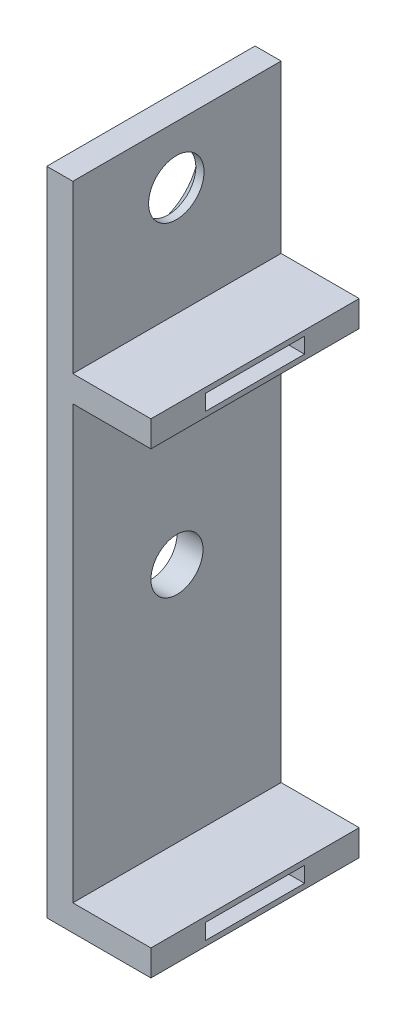
ISO-10303-21;
HEADER;
FILE_DESCRIPTION(('STEP AP214'),'2;1');
FILE_NAME('part.step','',(''),(''),'','','');
FILE_SCHEMA(('AUTOMOTIVE_DESIGN { 1 0 10303 214 1 1 1 1 }'));
ENDSEC;
DATA;
#1=APPLICATION_CONTEXT('core data for automotive mechanical design processes');
#2=APPLICATION_PROTOCOL_DEFINITION('international standard','automotive_design',2000,#1);
#3=PRODUCT_CONTEXT('',#1,'mechanical');
#4=PRODUCT('Part','Part','',(#3));
#5=PRODUCT_RELATED_PRODUCT_CATEGORY('part','',(#4));
#6=PRODUCT_DEFINITION_FORMATION('','',#4);
#7=PRODUCT_DEFINITION_CONTEXT('part definition',#1,'design');
#8=PRODUCT_DEFINITION('design','',#6,#7);
#9=PRODUCT_DEFINITION_SHAPE('','',#8);
#10=(LENGTH_UNIT() NAMED_UNIT(*) SI_UNIT(.MILLI.,.METRE.));
#11=(NAMED_UNIT(*) PLANE_ANGLE_UNIT() SI_UNIT($,.RADIAN.));
#12=(NAMED_UNIT(*) SI_UNIT($,.STERADIAN.) SOLID_ANGLE_UNIT());
#13=UNCERTAINTY_MEASURE_WITH_UNIT(LENGTH_MEASURE(1.E-05),#10,'distance_accuracy_value','');
#14=(GEOMETRIC_REPRESENTATION_CONTEXT(3) GLOBAL_UNCERTAINTY_ASSIGNED_CONTEXT((#13)) GLOBAL_UNIT_ASSIGNED_CONTEXT((#10,
#11,#12)) REPRESENTATION_CONTEXT('',''));
#15=CARTESIAN_POINT('',(0.,0.,0.));
#16=DIRECTION('',(0.,0.,1.));
#17=DIRECTION('',(1.,0.,0.));
#18=AXIS2_PLACEMENT_3D('',#15,#16,#17);
#19=CARTESIAN_POINT('',(-22.4832333333333,11.63955,10.16));
#20=DIRECTION('',(-1.,0.,0.));
#21=DIRECTION('',(0.,-1.,0.));
#22=AXIS2_PLACEMENT_3D('',#19,#20,#21);
#23=PLANE('',#22);
#24=CARTESIAN_POINT('',(-22.4832333333333,-7.08439638807882,5.08));
#25=DIRECTION('',(1.,0.,0.));
#26=DIRECTION('',(0.,1.,0.));
#27=AXIS2_PLACEMENT_3D('',#24,#25,#26);
#28=CIRCLE('',#27,1.27);
#29=CARTESIAN_POINT('',(-22.4832333333333,-5.81439638807882,5.08));
#30=VERTEX_POINT('',#29);
#31=EDGE_CURVE('E199',#30,#30,#28,.T.);
#32=ORIENTED_EDGE('',*,*,#31,.F.);
#33=EDGE_LOOP('',(#32));
#34=FACE_BOUND('',#33,.T.);
#35=DIRECTION('',(0.,0.,-1.));
#36=VECTOR('',#35,1.);
#37=CARTESIAN_POINT('',(-22.4832333333333,2.24155,10.16));
#38=LINE('',#37,#36);
#39=CARTESIAN_POINT('',(-22.4832333333333,2.24155000000001,10.16));
#40=VERTEX_POINT('',#39);
#41=CARTESIAN_POINT('',(-22.4832333333333,2.24155000000001,0.));
#42=VERTEX_POINT('',#41);
#43=EDGE_CURVE('E257',#40,#42,#38,.T.);
#44=ORIENTED_EDGE('',*,*,#43,.F.);
#45=DIRECTION('',(0.,1.,0.));
#46=VECTOR('',#45,1.);
#47=CARTESIAN_POINT('',(-22.4832333333333,11.63955,10.16));
#48=LINE('',#47,#46);
#49=CARTESIAN_POINT('',(-22.4832333333333,-18.84045,10.16));
#50=VERTEX_POINT('',#49);
#51=EDGE_CURVE('E321',#50,#40,#48,.T.);
#52=ORIENTED_EDGE('',*,*,#51,.F.);
#53=DIRECTION('',(0.,0.,-1.));
#54=VECTOR('',#53,1.);
#55=CARTESIAN_POINT('',(-22.4832333333333,-18.84045,10.16));
#56=LINE('',#55,#54);
#57=CARTESIAN_POINT('',(-22.4832333333333,-18.84045,0.));
#58=VERTEX_POINT('',#57);
#59=EDGE_CURVE('E347',#50,#58,#56,.T.);
#60=ORIENTED_EDGE('',*,*,#59,.T.);
#61=DIRECTION('',(0.,1.,0.));
#62=VECTOR('',#61,1.);
#63=CARTESIAN_POINT('',(-22.4832333333333,11.63955,0.));
#64=LINE('',#63,#62);
#65=EDGE_CURVE('E308',#58,#42,#64,.T.);
#66=ORIENTED_EDGE('',*,*,#65,.T.);
#67=EDGE_LOOP('',(#44,#52,#60,#66));
#68=FACE_BOUND('',#67,.T.);
#69=ADVANCED_FACE('F41',(#34,#68),#23,.F.);
#70=CARTESIAN_POINT('',(-22.4832333333333,8.84555,5.11168207856704));
#71=DIRECTION('',(-1.,0.,0.));
#72=DIRECTION('',(0.,-1.,0.));
#73=AXIS2_PLACEMENT_3D('',#70,#71,#72);
#74=CIRCLE('',#73,1.35254999999999);
#75=CARTESIAN_POINT('',(-22.4832333333333,7.49300000000001,5.11168207856704));
#76=VERTEX_POINT('',#75);
#77=EDGE_CURVE('E45',#76,#76,#74,.T.);
#78=ORIENTED_EDGE('',*,*,#77,.T.);
#79=EDGE_LOOP('',(#78));
#80=FACE_BOUND('',#79,.T.);
#81=DIRECTION('',(0.,0.,1.));
#82=VECTOR('',#81,1.);
#83=CARTESIAN_POINT('',(-22.4832333333333,3.51155,0.));
#84=LINE('',#83,#82);
#85=CARTESIAN_POINT('',(-22.4832333333333,3.51155,0.));
#86=VERTEX_POINT('',#85);
#87=CARTESIAN_POINT('',(-22.4832333333333,3.51155000000001,10.16));
#88=VERTEX_POINT('',#87);
#89=EDGE_CURVE('E271',#86,#88,#84,.T.);
#90=ORIENTED_EDGE('',*,*,#89,.F.);
#91=CARTESIAN_POINT('',(-22.4832333333333,11.63955,0.));
#92=VERTEX_POINT('',#91);
#93=EDGE_CURVE('E341',#86,#92,#64,.T.);
#94=ORIENTED_EDGE('',*,*,#93,.T.);
#95=DIRECTION('',(0.,0.,-1.));
#96=VECTOR('',#95,1.);
#97=CARTESIAN_POINT('',(-22.4832333333333,11.63955,10.16));
#98=LINE('',#97,#96);
#99=CARTESIAN_POINT('',(-22.4832333333333,11.63955,10.16));
#100=VERTEX_POINT('',#99);
#101=EDGE_CURVE('E325',#100,#92,#98,.T.);
#102=ORIENTED_EDGE('',*,*,#101,.F.);
#103=EDGE_CURVE('E320',#88,#100,#48,.T.);
#104=ORIENTED_EDGE('',*,*,#103,.F.);
#105=EDGE_LOOP('',(#90,#94,#102,#104));
#106=FACE_BOUND('',#105,.T.);
#107=ADVANCED_FACE('F423',(#80,#106),#23,.F.);
#108=CARTESIAN_POINT('',(-23.7532333333333,11.63955,10.16));
#109=DIRECTION('',(0.,-1.,0.));
#110=DIRECTION('',(0.,0.,-1.));
#111=AXIS2_PLACEMENT_3D('',#108,#109,#110);
#112=PLANE('',#111);
#113=DIRECTION('',(-1.,0.,0.));
#114=VECTOR('',#113,1.);
#115=CARTESIAN_POINT('',(-23.7532333333333,11.63955,0.));
#116=LINE('',#115,#114);
#117=CARTESIAN_POINT('',(-23.7532333333333,11.63955,0.));
#118=VERTEX_POINT('',#117);
#119=EDGE_CURVE('E302',#92,#118,#116,.T.);
#120=ORIENTED_EDGE('',*,*,#119,.T.);
#121=DIRECTION('',(0.,0.,-1.));
#122=VECTOR('',#121,1.);
#123=CARTESIAN_POINT('',(-23.7532333333333,11.63955,10.16));
#124=LINE('',#123,#122);
#125=CARTESIAN_POINT('',(-23.7532333333333,11.63955,10.16));
#126=VERTEX_POINT('',#125);
#127=EDGE_CURVE('E11',#126,#118,#124,.T.);
#128=ORIENTED_EDGE('',*,*,#127,.F.);
#129=DIRECTION('',(-1.,0.,0.));
#130=VECTOR('',#129,1.);
#131=CARTESIAN_POINT('',(-23.7532333333333,11.63955,10.16));
#132=LINE('',#131,#130);
#133=EDGE_CURVE('E303',#100,#126,#132,.T.);
#134=ORIENTED_EDGE('',*,*,#133,.F.);
#135=ORIENTED_EDGE('',*,*,#101,.T.);
#136=EDGE_LOOP('',(#120,#128,#134,#135));
#137=FACE_BOUND('',#136,.T.);
#138=ADVANCED_FACE('F43',(#137),#112,.F.);
#139=CARTESIAN_POINT('',(-23.7532333333333,-20.11045,10.16));
#140=DIRECTION('',(1.,0.,0.));
#141=DIRECTION('',(0.,0.,-1.));
#142=AXIS2_PLACEMENT_3D('',#139,#140,#141);
#143=PLANE('',#142);
#144=CARTESIAN_POINT('',(-23.7532333333333,8.84555,5.11168207856704));
#145=DIRECTION('',(-1.,0.,0.));
#146=DIRECTION('',(0.,0.,1.));
#147=AXIS2_PLACEMENT_3D('',#144,#145,#146);
#148=CIRCLE('',#147,2.3876);
#149=CARTESIAN_POINT('',(-23.7532333333333,8.84555,7.49928207856704));
#150=VERTEX_POINT('',#149);
#151=EDGE_CURVE('E376',#150,#150,#148,.T.);
#152=ORIENTED_EDGE('',*,*,#151,.F.);
#153=EDGE_LOOP('',(#152));
#154=FACE_BOUND('',#153,.T.);
#155=CARTESIAN_POINT('',(-23.7532333333333,-7.08439638807882,5.08));
#156=DIRECTION('',(1.,0.,0.));
#157=DIRECTION('',(0.,0.,-1.));
#158=AXIS2_PLACEMENT_3D('',#155,#156,#157);
#159=CIRCLE('',#158,1.27);
#160=CARTESIAN_POINT('',(-23.7532333333333,-7.08439638807882,3.81));
#161=VERTEX_POINT('',#160);
#162=EDGE_CURVE('E209',#161,#161,#159,.T.);
#163=ORIENTED_EDGE('',*,*,#162,.T.);
#164=EDGE_LOOP('',(#163));
#165=FACE_BOUND('',#164,.T.);
#166=DIRECTION('',(0.,-1.,0.));
#167=VECTOR('',#166,1.);
#168=CARTESIAN_POINT('',(-23.7532333333333,-20.11045,0.));
#169=LINE('',#168,#167);
#170=CARTESIAN_POINT('',(-23.7532333333333,-20.11045,0.));
#171=VERTEX_POINT('',#170);
#172=EDGE_CURVE('E329',#118,#171,#169,.T.);
#173=ORIENTED_EDGE('',*,*,#172,.T.);
#174=DIRECTION('',(0.,0.,-1.));
#175=VECTOR('',#174,1.);
#176=CARTESIAN_POINT('',(-23.7532333333333,-20.11045,10.16));
#177=LINE('',#176,#175);
#178=CARTESIAN_POINT('',(-23.7532333333333,-20.11045,10.16));
#179=VERTEX_POINT('',#178);
#180=EDGE_CURVE('E51',#179,#171,#177,.T.);
#181=ORIENTED_EDGE('',*,*,#180,.F.);
#182=DIRECTION('',(0.,-1.,0.));
#183=VECTOR('',#182,1.);
#184=CARTESIAN_POINT('',(-23.7532333333333,-20.11045,10.16));
#185=LINE('',#184,#183);
#186=EDGE_CURVE('E307',#126,#179,#185,.T.);
#187=ORIENTED_EDGE('',*,*,#186,.F.);
#188=ORIENTED_EDGE('',*,*,#127,.T.);
#189=EDGE_LOOP('',(#173,#181,#187,#188));
#190=FACE_BOUND('',#189,.T.);
#191=ADVANCED_FACE('F386',(#154,#165,#190),#143,.F.);
#192=CARTESIAN_POINT('',(-18.6732333333333,-20.11045,10.16));
#193=DIRECTION('',(0.,1.,0.));
#194=DIRECTION('',(0.,0.,1.));
#195=AXIS2_PLACEMENT_3D('',#192,#193,#194);
#196=PLANE('',#195);
#197=DIRECTION('',(1.,0.,0.));
#198=VECTOR('',#197,1.);
#199=CARTESIAN_POINT('',(-18.6732333333333,-20.11045,0.));
#200=LINE('',#199,#198);
#201=CARTESIAN_POINT('',(-18.6732333333333,-20.11045,0.));
#202=VERTEX_POINT('',#201);
#203=EDGE_CURVE('E332',#171,#202,#200,.T.);
#204=ORIENTED_EDGE('',*,*,#203,.T.);
#205=DIRECTION('',(0.,0.,-1.));
#206=VECTOR('',#205,1.);
#207=CARTESIAN_POINT('',(-18.6732333333333,-20.11045,10.16));
#208=LINE('',#207,#206);
#209=CARTESIAN_POINT('',(-18.6732333333333,-20.11045,10.16));
#210=VERTEX_POINT('',#209);
#211=EDGE_CURVE('E355',#210,#202,#208,.T.);
#212=ORIENTED_EDGE('',*,*,#211,.F.);
#213=DIRECTION('',(1.,0.,0.));
#214=VECTOR('',#213,1.);
#215=CARTESIAN_POINT('',(-18.6732333333333,-20.11045,10.16));
#216=LINE('',#215,#214);
#217=EDGE_CURVE('E311',#179,#210,#216,.T.);
#218=ORIENTED_EDGE('',*,*,#217,.F.);
#219=ORIENTED_EDGE('',*,*,#180,.T.);
#220=EDGE_LOOP('',(#204,#212,#218,#219));
#221=FACE_BOUND('',#220,.T.);
#222=ADVANCED_FACE('F388',(#221),#196,.F.);
#223=CARTESIAN_POINT('',(-18.6732333333333,-18.84045,10.16));
#224=DIRECTION('',(-1.,0.,0.));
#225=DIRECTION('',(0.,0.,1.));
#226=AXIS2_PLACEMENT_3D('',#223,#224,#225);
#227=PLANE('',#226);
#228=DIRECTION('',(0.,0.,-1.));
#229=VECTOR('',#228,1.);
#230=CARTESIAN_POINT('',(-18.6732333333333,-19.85645,7.493));
#231=LINE('',#230,#229);
#232=CARTESIAN_POINT('',(-18.6732333333333,-19.85645,7.493));
#233=VERTEX_POINT('',#232);
#234=CARTESIAN_POINT('',(-18.6732333333333,-19.85645,2.667));
#235=VERTEX_POINT('',#234);
#236=EDGE_CURVE('E208',#233,#235,#231,.T.);
#237=ORIENTED_EDGE('',*,*,#236,.F.);
#238=DIRECTION('',(0.,-1.,0.));
#239=VECTOR('',#238,1.);
#240=CARTESIAN_POINT('',(-18.6732333333333,-19.09445,7.493));
#241=LINE('',#240,#239);
#242=CARTESIAN_POINT('',(-18.6732333333333,-19.09445,7.493));
#243=VERTEX_POINT('',#242);
#244=EDGE_CURVE('E59',#243,#233,#241,.T.);
#245=ORIENTED_EDGE('',*,*,#244,.F.);
#246=DIRECTION('',(0.,0.,1.));
#247=VECTOR('',#246,1.);
#248=CARTESIAN_POINT('',(-18.6732333333333,-19.09445,2.667));
#249=LINE('',#248,#247);
#250=CARTESIAN_POINT('',(-18.6732333333333,-19.09445,2.667));
#251=VERTEX_POINT('',#250);
#252=EDGE_CURVE('E192',#251,#243,#249,.T.);
#253=ORIENTED_EDGE('',*,*,#252,.F.);
#254=DIRECTION('',(0.,1.,0.));
#255=VECTOR('',#254,1.);
#256=CARTESIAN_POINT('',(-18.6732333333333,-19.85645,2.667));
#257=LINE('',#256,#255);
#258=EDGE_CURVE('E196',#235,#251,#257,.T.);
#259=ORIENTED_EDGE('',*,*,#258,.F.);
#260=EDGE_LOOP('',(#237,#245,#253,#259));
#261=FACE_BOUND('',#260,.T.);
#262=DIRECTION('',(0.,1.,0.));
#263=VECTOR('',#262,1.);
#264=CARTESIAN_POINT('',(-18.6732333333333,-18.84045,0.));
#265=LINE('',#264,#263);
#266=CARTESIAN_POINT('',(-18.6732333333333,-18.84045,0.));
#267=VERTEX_POINT('',#266);
#268=EDGE_CURVE('E335',#202,#267,#265,.T.);
#269=ORIENTED_EDGE('',*,*,#268,.T.);
#270=DIRECTION('',(0.,0.,-1.));
#271=VECTOR('',#270,1.);
#272=CARTESIAN_POINT('',(-18.6732333333333,-18.84045,10.16));
#273=LINE('',#272,#271);
#274=CARTESIAN_POINT('',(-18.6732333333333,-18.84045,10.16));
#275=VERTEX_POINT('',#274);
#276=EDGE_CURVE('E351',#275,#267,#273,.T.);
#277=ORIENTED_EDGE('',*,*,#276,.F.);
#278=DIRECTION('',(0.,1.,0.));
#279=VECTOR('',#278,1.);
#280=CARTESIAN_POINT('',(-18.6732333333333,-18.84045,10.16));
#281=LINE('',#280,#279);
#282=EDGE_CURVE('E314',#210,#275,#281,.T.);
#283=ORIENTED_EDGE('',*,*,#282,.F.);
#284=ORIENTED_EDGE('',*,*,#211,.T.);
#285=EDGE_LOOP('',(#269,#277,#283,#284));
#286=FACE_BOUND('',#285,.T.);
#287=ADVANCED_FACE('F404',(#261,#286),#227,.F.);
#288=CARTESIAN_POINT('',(-22.4832333333333,-18.84045,10.16));
#289=DIRECTION('',(0.,-1.,0.));
#290=DIRECTION('',(0.,0.,-1.));
#291=AXIS2_PLACEMENT_3D('',#288,#289,#290);
#292=PLANE('',#291);
#293=DIRECTION('',(-1.,0.,0.));
#294=VECTOR('',#293,1.);
#295=CARTESIAN_POINT('',(-22.4832333333333,-18.84045,0.));
#296=LINE('',#295,#294);
#297=EDGE_CURVE('E338',#267,#58,#296,.T.);
#298=ORIENTED_EDGE('',*,*,#297,.T.);
#299=ORIENTED_EDGE('',*,*,#59,.F.);
#300=DIRECTION('',(-1.,0.,0.));
#301=VECTOR('',#300,1.);
#302=CARTESIAN_POINT('',(-22.4832333333333,-18.84045,10.16));
#303=LINE('',#302,#301);
#304=EDGE_CURVE('E317',#275,#50,#303,.T.);
#305=ORIENTED_EDGE('',*,*,#304,.F.);
#306=ORIENTED_EDGE('',*,*,#276,.T.);
#307=EDGE_LOOP('',(#298,#299,#305,#306));
#308=FACE_BOUND('',#307,.T.);
#309=ADVANCED_FACE('F408',(#308),#292,.F.);
#310=CARTESIAN_POINT('',(0.,0.,10.16));
#311=DIRECTION('',(0.,0.,-1.));
#312=DIRECTION('',(-1.,0.,0.));
#313=AXIS2_PLACEMENT_3D('',#310,#311,#312);
#314=PLANE('',#313);
#315=ORIENTED_EDGE('',*,*,#133,.T.);
#316=ORIENTED_EDGE('',*,*,#186,.T.);
#317=ORIENTED_EDGE('',*,*,#217,.T.);
#318=ORIENTED_EDGE('',*,*,#282,.T.);
#319=ORIENTED_EDGE('',*,*,#304,.T.);
#320=ORIENTED_EDGE('',*,*,#51,.T.);
#321=DIRECTION('',(-1.,0.,0.));
#322=VECTOR('',#321,1.);
#323=CARTESIAN_POINT('',(-18.6732333333333,2.24155,10.16));
#324=LINE('',#323,#322);
#325=CARTESIAN_POINT('',(-18.6732333333333,2.24155,10.16));
#326=VERTEX_POINT('',#325);
#327=EDGE_CURVE('E298',#326,#40,#324,.T.);
#328=ORIENTED_EDGE('',*,*,#327,.F.);
#329=DIRECTION('',(0.,-1.,0.));
#330=VECTOR('',#329,1.);
#331=CARTESIAN_POINT('',(-18.6732333333333,3.51155,10.16));
#332=LINE('',#331,#330);
#333=CARTESIAN_POINT('',(-18.6732333333333,3.51155,10.16));
#334=VERTEX_POINT('',#333);
#335=EDGE_CURVE('E266',#334,#326,#332,.T.);
#336=ORIENTED_EDGE('',*,*,#335,.F.);
#337=DIRECTION('',(-1.,0.,0.));
#338=VECTOR('',#337,1.);
#339=CARTESIAN_POINT('',(-18.6732333333333,3.51155,10.16));
#340=LINE('',#339,#338);
#341=EDGE_CURVE('E280',#334,#88,#340,.T.);
#342=ORIENTED_EDGE('',*,*,#341,.T.);
#343=ORIENTED_EDGE('',*,*,#103,.T.);
#344=EDGE_LOOP('',(#315,#316,#317,#318,#319,#320,#328,#336,#342,#343));
#345=FACE_BOUND('',#344,.T.);
#346=ADVANCED_FACE('F412',(#345),#314,.F.);
#347=CARTESIAN_POINT('',(0.,0.,0.));
#348=DIRECTION('',(0.,0.,-1.));
#349=DIRECTION('',(-1.,0.,0.));
#350=AXIS2_PLACEMENT_3D('',#347,#348,#349);
#351=PLANE('',#350);
#352=ORIENTED_EDGE('',*,*,#119,.F.);
#353=ORIENTED_EDGE('',*,*,#93,.F.);
#354=DIRECTION('',(-1.,0.,0.));
#355=VECTOR('',#354,1.);
#356=CARTESIAN_POINT('',(-18.6732333333333,3.51155,0.));
#357=LINE('',#356,#355);
#358=CARTESIAN_POINT('',(-18.6732333333333,3.51155,0.));
#359=VERTEX_POINT('',#358);
#360=EDGE_CURVE('E290',#359,#86,#357,.T.);
#361=ORIENTED_EDGE('',*,*,#360,.F.);
#362=DIRECTION('',(0.,1.,0.));
#363=VECTOR('',#362,1.);
#364=CARTESIAN_POINT('',(-18.6732333333333,2.24155,0.));
#365=LINE('',#364,#363);
#366=CARTESIAN_POINT('',(-18.6732333333333,2.24155,0.));
#367=VERTEX_POINT('',#366);
#368=EDGE_CURVE('E274',#367,#359,#365,.T.);
#369=ORIENTED_EDGE('',*,*,#368,.F.);
#370=DIRECTION('',(-1.,0.,0.));
#371=VECTOR('',#370,1.);
#372=CARTESIAN_POINT('',(-18.6732333333333,2.24155,0.));
#373=LINE('',#372,#371);
#374=EDGE_CURVE('E294',#367,#42,#373,.T.);
#375=ORIENTED_EDGE('',*,*,#374,.T.);
#376=ORIENTED_EDGE('',*,*,#65,.F.);
#377=ORIENTED_EDGE('',*,*,#297,.F.);
#378=ORIENTED_EDGE('',*,*,#268,.F.);
#379=ORIENTED_EDGE('',*,*,#203,.F.);
#380=ORIENTED_EDGE('',*,*,#172,.F.);
#381=EDGE_LOOP('',(#352,#353,#361,#369,#375,#376,#377,#378,#379,#380));
#382=FACE_BOUND('',#381,.T.);
#383=ADVANCED_FACE('F399',(#382),#351,.T.);
#384=CARTESIAN_POINT('',(-18.6732333333333,2.24155,10.16));
#385=DIRECTION('',(0.,1.,0.));
#386=DIRECTION('',(-1.,0.,0.));
#387=AXIS2_PLACEMENT_3D('',#384,#385,#386);
#388=PLANE('',#387);
#389=ORIENTED_EDGE('',*,*,#43,.T.);
#390=ORIENTED_EDGE('',*,*,#374,.F.);
#391=DIRECTION('',(0.,0.,-1.));
#392=VECTOR('',#391,1.);
#393=CARTESIAN_POINT('',(-18.6732333333333,2.24155,10.16));
#394=LINE('',#393,#392);
#395=EDGE_CURVE('E270',#326,#367,#394,.T.);
#396=ORIENTED_EDGE('',*,*,#395,.F.);
#397=ORIENTED_EDGE('',*,*,#327,.T.);
#398=EDGE_LOOP('',(#389,#390,#396,#397));
#399=FACE_BOUND('',#398,.T.);
#400=ADVANCED_FACE('F432',(#399),#388,.F.);
#401=CARTESIAN_POINT('',(-18.6732333333333,3.51155,0.));
#402=DIRECTION('',(0.,-1.,0.));
#403=DIRECTION('',(0.,0.,-1.));
#404=AXIS2_PLACEMENT_3D('',#401,#402,#403);
#405=PLANE('',#404);
#406=ORIENTED_EDGE('',*,*,#89,.T.);
#407=ORIENTED_EDGE('',*,*,#341,.F.);
#408=DIRECTION('',(0.,0.,1.));
#409=VECTOR('',#408,1.);
#410=CARTESIAN_POINT('',(-18.6732333333333,3.51155,0.));
#411=LINE('',#410,#409);
#412=EDGE_CURVE('E277',#359,#334,#411,.T.);
#413=ORIENTED_EDGE('',*,*,#412,.F.);
#414=ORIENTED_EDGE('',*,*,#360,.T.);
#415=EDGE_LOOP('',(#406,#407,#413,#414));
#416=FACE_BOUND('',#415,.T.);
#417=ADVANCED_FACE('F426',(#416),#405,.F.);
#418=CARTESIAN_POINT('',(-18.6732333333333,0.,0.));
#419=DIRECTION('',(1.,0.,0.));
#420=DIRECTION('',(0.,0.,-1.));
#421=AXIS2_PLACEMENT_3D('',#418,#419,#420);
#422=PLANE('',#421);
#423=DIRECTION('',(0.,0.,1.));
#424=VECTOR('',#423,1.);
#425=CARTESIAN_POINT('',(-18.6732333333333,3.25755,2.667));
#426=LINE('',#425,#424);
#427=CARTESIAN_POINT('',(-18.6732333333333,3.25755,2.667));
#428=VERTEX_POINT('',#427);
#429=CARTESIAN_POINT('',(-18.6732333333333,3.25755,7.493));
#430=VERTEX_POINT('',#429);
#431=EDGE_CURVE('E67',#428,#430,#426,.T.);
#432=ORIENTED_EDGE('',*,*,#431,.F.);
#433=DIRECTION('',(0.,1.,0.));
#434=VECTOR('',#433,1.);
#435=CARTESIAN_POINT('',(-18.6732333333333,2.49555,2.667));
#436=LINE('',#435,#434);
#437=CARTESIAN_POINT('',(-18.6732333333333,2.49555,2.667));
#438=VERTEX_POINT('',#437);
#439=EDGE_CURVE('E228',#438,#428,#436,.T.);
#440=ORIENTED_EDGE('',*,*,#439,.F.);
#441=DIRECTION('',(0.,0.,-1.));
#442=VECTOR('',#441,1.);
#443=CARTESIAN_POINT('',(-18.6732333333333,2.49555,7.493));
#444=LINE('',#443,#442);
#445=CARTESIAN_POINT('',(-18.6732333333333,2.49555,7.493));
#446=VERTEX_POINT('',#445);
#447=EDGE_CURVE('E247',#446,#438,#444,.T.);
#448=ORIENTED_EDGE('',*,*,#447,.F.);
#449=DIRECTION('',(0.,-1.,0.));
#450=VECTOR('',#449,1.);
#451=CARTESIAN_POINT('',(-18.6732333333333,3.25755,7.493));
#452=LINE('',#451,#450);
#453=EDGE_CURVE('E243',#430,#446,#452,.T.);
#454=ORIENTED_EDGE('',*,*,#453,.F.);
#455=EDGE_LOOP('',(#432,#440,#448,#454));
#456=FACE_BOUND('',#455,.T.);
#457=ORIENTED_EDGE('',*,*,#335,.T.);
#458=ORIENTED_EDGE('',*,*,#395,.T.);
#459=ORIENTED_EDGE('',*,*,#368,.T.);
#460=ORIENTED_EDGE('',*,*,#412,.T.);
#461=EDGE_LOOP('',(#457,#458,#459,#460));
#462=FACE_BOUND('',#461,.T.);
#463=ADVANCED_FACE('F429',(#456,#462),#422,.T.);
#464=CARTESIAN_POINT('',(-20.9084333333333,3.25755,2.667));
#465=DIRECTION('',(0.,1.,0.));
#466=DIRECTION('',(0.,0.,1.));
#467=AXIS2_PLACEMENT_3D('',#464,#465,#466);
#468=PLANE('',#467);
#469=ORIENTED_EDGE('',*,*,#431,.T.);
#470=DIRECTION('',(1.,0.,0.));
#471=VECTOR('',#470,1.);
#472=CARTESIAN_POINT('',(-20.9084333333333,3.25755,7.493));
#473=LINE('',#472,#471);
#474=CARTESIAN_POINT('',(-20.9084333333333,3.25755,7.493));
#475=VERTEX_POINT('',#474);
#476=EDGE_CURVE('E240',#475,#430,#473,.T.);
#477=ORIENTED_EDGE('',*,*,#476,.F.);
#478=DIRECTION('',(0.,0.,1.));
#479=VECTOR('',#478,1.);
#480=CARTESIAN_POINT('',(-20.9084333333333,3.25755,2.667));
#481=LINE('',#480,#479);
#482=CARTESIAN_POINT('',(-20.9084333333333,3.25755,2.667));
#483=VERTEX_POINT('',#482);
#484=EDGE_CURVE('E223',#483,#475,#481,.T.);
#485=ORIENTED_EDGE('',*,*,#484,.F.);
#486=DIRECTION('',(1.,0.,0.));
#487=VECTOR('',#486,1.);
#488=CARTESIAN_POINT('',(-20.9084333333333,3.25755,2.667));
#489=LINE('',#488,#487);
#490=EDGE_CURVE('E254',#483,#428,#489,.T.);
#491=ORIENTED_EDGE('',*,*,#490,.T.);
#492=EDGE_LOOP('',(#469,#477,#485,#491));
#493=FACE_BOUND('',#492,.T.);
#494=ADVANCED_FACE('F493',(#493),#468,.F.);
#495=CARTESIAN_POINT('',(-20.9084333333333,2.49555,2.667));
#496=DIRECTION('',(0.,0.,-1.));
#497=DIRECTION('',(-1.,0.,0.));
#498=AXIS2_PLACEMENT_3D('',#495,#496,#497);
#499=PLANE('',#498);
#500=ORIENTED_EDGE('',*,*,#439,.T.);
#501=ORIENTED_EDGE('',*,*,#490,.F.);
#502=DIRECTION('',(0.,1.,0.));
#503=VECTOR('',#502,1.);
#504=CARTESIAN_POINT('',(-20.9084333333333,2.49555,2.667));
#505=LINE('',#504,#503);
#506=CARTESIAN_POINT('',(-20.9084333333333,2.49555,2.667));
#507=VERTEX_POINT('',#506);
#508=EDGE_CURVE('E236',#507,#483,#505,.T.);
#509=ORIENTED_EDGE('',*,*,#508,.F.);
#510=DIRECTION('',(1.,0.,0.));
#511=VECTOR('',#510,1.);
#512=CARTESIAN_POINT('',(-20.9084333333333,2.49555,2.667));
#513=LINE('',#512,#511);
#514=EDGE_CURVE('E258',#507,#438,#513,.T.);
#515=ORIENTED_EDGE('',*,*,#514,.T.);
#516=EDGE_LOOP('',(#500,#501,#509,#515));
#517=FACE_BOUND('',#516,.T.);
#518=ADVANCED_FACE('F501',(#517),#499,.F.);
#519=CARTESIAN_POINT('',(-20.9084333333333,2.49555,7.493));
#520=DIRECTION('',(0.,-1.,0.));
#521=DIRECTION('',(0.,0.,-1.));
#522=AXIS2_PLACEMENT_3D('',#519,#520,#521);
#523=PLANE('',#522);
#524=ORIENTED_EDGE('',*,*,#447,.T.);
#525=ORIENTED_EDGE('',*,*,#514,.F.);
#526=DIRECTION('',(0.,0.,-1.));
#527=VECTOR('',#526,1.);
#528=CARTESIAN_POINT('',(-20.9084333333333,2.49555,7.493));
#529=LINE('',#528,#527);
#530=CARTESIAN_POINT('',(-20.9084333333333,2.49555,7.493));
#531=VERTEX_POINT('',#530);
#532=EDGE_CURVE('E232',#531,#507,#529,.T.);
#533=ORIENTED_EDGE('',*,*,#532,.F.);
#534=DIRECTION('',(1.,0.,0.));
#535=VECTOR('',#534,1.);
#536=CARTESIAN_POINT('',(-20.9084333333333,2.49555,7.493));
#537=LINE('',#536,#535);
#538=EDGE_CURVE('E261',#531,#446,#537,.T.);
#539=ORIENTED_EDGE('',*,*,#538,.T.);
#540=EDGE_LOOP('',(#524,#525,#533,#539));
#541=FACE_BOUND('',#540,.T.);
#542=ADVANCED_FACE('F508',(#541),#523,.F.);
#543=CARTESIAN_POINT('',(-20.9084333333333,3.25755,7.493));
#544=DIRECTION('',(0.,0.,1.));
#545=DIRECTION('',(0.,-1.,0.));
#546=AXIS2_PLACEMENT_3D('',#543,#544,#545);
#547=PLANE('',#546);
#548=ORIENTED_EDGE('',*,*,#453,.T.);
#549=ORIENTED_EDGE('',*,*,#538,.F.);
#550=DIRECTION('',(0.,-1.,0.));
#551=VECTOR('',#550,1.);
#552=CARTESIAN_POINT('',(-20.9084333333333,3.25755,7.493));
#553=LINE('',#552,#551);
#554=EDGE_CURVE('E227',#475,#531,#553,.T.);
#555=ORIENTED_EDGE('',*,*,#554,.F.);
#556=ORIENTED_EDGE('',*,*,#476,.T.);
#557=EDGE_LOOP('',(#548,#549,#555,#556));
#558=FACE_BOUND('',#557,.T.);
#559=ADVANCED_FACE('F516',(#558),#547,.F.);
#560=CARTESIAN_POINT('',(-20.9084333333333,0.,0.));
#561=DIRECTION('',(1.,0.,0.));
#562=DIRECTION('',(0.,0.,-1.));
#563=AXIS2_PLACEMENT_3D('',#560,#561,#562);
#564=PLANE('',#563);
#565=ORIENTED_EDGE('',*,*,#484,.T.);
#566=ORIENTED_EDGE('',*,*,#554,.T.);
#567=ORIENTED_EDGE('',*,*,#532,.T.);
#568=ORIENTED_EDGE('',*,*,#508,.T.);
#569=EDGE_LOOP('',(#565,#566,#567,#568));
#570=FACE_BOUND('',#569,.T.);
#571=ADVANCED_FACE('F524',(#570),#564,.T.);
#572=CARTESIAN_POINT('',(-20.9084333333333,-19.09445,7.493));
#573=DIRECTION('',(0.,0.,1.));
#574=DIRECTION('',(1.,0.,0.));
#575=AXIS2_PLACEMENT_3D('',#572,#573,#574);
#576=PLANE('',#575);
#577=ORIENTED_EDGE('',*,*,#244,.T.);
#578=DIRECTION('',(1.,0.,0.));
#579=VECTOR('',#578,1.);
#580=CARTESIAN_POINT('',(-20.9084333333333,-19.85645,7.493));
#581=LINE('',#580,#579);
#582=CARTESIAN_POINT('',(-20.9084333333333,-19.85645,7.493));
#583=VERTEX_POINT('',#582);
#584=EDGE_CURVE('E167',#583,#233,#581,.T.);
#585=ORIENTED_EDGE('',*,*,#584,.F.);
#586=DIRECTION('',(0.,-1.,0.));
#587=VECTOR('',#586,1.);
#588=CARTESIAN_POINT('',(-20.9084333333333,-19.09445,7.493));
#589=LINE('',#588,#587);
#590=CARTESIAN_POINT('',(-20.9084333333333,-19.09445,7.493));
#591=VERTEX_POINT('',#590);
#592=EDGE_CURVE('E171',#591,#583,#589,.T.);
#593=ORIENTED_EDGE('',*,*,#592,.F.);
#594=DIRECTION('',(1.,0.,0.));
#595=VECTOR('',#594,1.);
#596=CARTESIAN_POINT('',(-20.9084333333333,-19.09445,7.493));
#597=LINE('',#596,#595);
#598=EDGE_CURVE('E215',#591,#243,#597,.T.);
#599=ORIENTED_EDGE('',*,*,#598,.T.);
#600=EDGE_LOOP('',(#577,#585,#593,#599));
#601=FACE_BOUND('',#600,.T.);
#602=ADVANCED_FACE('F169',(#601),#576,.F.);
#603=CARTESIAN_POINT('',(-20.9084333333333,-19.09445,2.667));
#604=DIRECTION('',(0.,1.,0.));
#605=DIRECTION('',(0.,0.,1.));
#606=AXIS2_PLACEMENT_3D('',#603,#604,#605);
#607=PLANE('',#606);
#608=ORIENTED_EDGE('',*,*,#252,.T.);
#609=ORIENTED_EDGE('',*,*,#598,.F.);
#610=DIRECTION('',(0.,0.,1.));
#611=VECTOR('',#610,1.);
#612=CARTESIAN_POINT('',(-20.9084333333333,-19.09445,2.667));
#613=LINE('',#612,#611);
#614=CARTESIAN_POINT('',(-20.9084333333333,-19.09445,2.667));
#615=VERTEX_POINT('',#614);
#616=EDGE_CURVE('E178',#615,#591,#613,.T.);
#617=ORIENTED_EDGE('',*,*,#616,.F.);
#618=DIRECTION('',(1.,0.,0.));
#619=VECTOR('',#618,1.);
#620=CARTESIAN_POINT('',(-20.9084333333333,-19.09445,2.667));
#621=LINE('',#620,#619);
#622=EDGE_CURVE('E218',#615,#251,#621,.T.);
#623=ORIENTED_EDGE('',*,*,#622,.T.);
#624=EDGE_LOOP('',(#608,#609,#617,#623));
#625=FACE_BOUND('',#624,.T.);
#626=ADVANCED_FACE('F537',(#625),#607,.F.);
#627=CARTESIAN_POINT('',(-20.9084333333333,-19.85645,2.667));
#628=DIRECTION('',(0.,0.,-1.));
#629=DIRECTION('',(-1.,0.,0.));
#630=AXIS2_PLACEMENT_3D('',#627,#628,#629);
#631=PLANE('',#630);
#632=ORIENTED_EDGE('',*,*,#258,.T.);
#633=ORIENTED_EDGE('',*,*,#622,.F.);
#634=DIRECTION('',(0.,1.,0.));
#635=VECTOR('',#634,1.);
#636=CARTESIAN_POINT('',(-20.9084333333333,-19.85645,2.667));
#637=LINE('',#636,#635);
#638=CARTESIAN_POINT('',(-20.9084333333333,-19.85645,2.667));
#639=VERTEX_POINT('',#638);
#640=EDGE_CURVE('E187',#639,#615,#637,.T.);
#641=ORIENTED_EDGE('',*,*,#640,.F.);
#642=DIRECTION('',(1.,0.,0.));
#643=VECTOR('',#642,1.);
#644=CARTESIAN_POINT('',(-20.9084333333333,-19.85645,2.667));
#645=LINE('',#644,#643);
#646=EDGE_CURVE('E177',#639,#235,#645,.T.);
#647=ORIENTED_EDGE('',*,*,#646,.T.);
#648=EDGE_LOOP('',(#632,#633,#641,#647));
#649=FACE_BOUND('',#648,.T.);
#650=ADVANCED_FACE('F544',(#649),#631,.F.);
#651=CARTESIAN_POINT('',(-20.9084333333333,-19.85645,7.493));
#652=DIRECTION('',(0.,-1.,0.));
#653=DIRECTION('',(0.,0.,-1.));
#654=AXIS2_PLACEMENT_3D('',#651,#652,#653);
#655=PLANE('',#654);
#656=ORIENTED_EDGE('',*,*,#236,.T.);
#657=ORIENTED_EDGE('',*,*,#646,.F.);
#658=DIRECTION('',(0.,0.,-1.));
#659=VECTOR('',#658,1.);
#660=CARTESIAN_POINT('',(-20.9084333333333,-19.85645,7.493));
#661=LINE('',#660,#659);
#662=EDGE_CURVE('E181',#583,#639,#661,.T.);
#663=ORIENTED_EDGE('',*,*,#662,.F.);
#664=ORIENTED_EDGE('',*,*,#584,.T.);
#665=EDGE_LOOP('',(#656,#657,#663,#664));
#666=FACE_BOUND('',#665,.T.);
#667=ADVANCED_FACE('F182',(#666),#655,.F.);
#668=CARTESIAN_POINT('',(-20.9084333333333,0.,0.));
#669=DIRECTION('',(1.,0.,0.));
#670=DIRECTION('',(0.,0.,-1.));
#671=AXIS2_PLACEMENT_3D('',#668,#669,#670);
#672=PLANE('',#671);
#673=ORIENTED_EDGE('',*,*,#592,.T.);
#674=ORIENTED_EDGE('',*,*,#662,.T.);
#675=ORIENTED_EDGE('',*,*,#640,.T.);
#676=ORIENTED_EDGE('',*,*,#616,.T.);
#677=EDGE_LOOP('',(#673,#674,#675,#676));
#678=FACE_BOUND('',#677,.T.);
#679=ADVANCED_FACE('F189',(#678),#672,.T.);
#680=CARTESIAN_POINT('',(-25.0232333333333,-7.08439638807882,5.08));
#681=DIRECTION('',(1.,0.,0.));
#682=DIRECTION('',(0.,1.,0.));
#683=AXIS2_PLACEMENT_3D('',#680,#681,#682);
#684=CYLINDRICAL_SURFACE('',#683,1.27);
#685=ORIENTED_EDGE('',*,*,#31,.T.);
#686=EDGE_LOOP('',(#685));
#687=FACE_BOUND('',#686,.T.);
#688=ORIENTED_EDGE('',*,*,#162,.F.);
#689=EDGE_LOOP('',(#688));
#690=FACE_BOUND('',#689,.T.);
#691=ADVANCED_FACE('F565',(#687,#690),#684,.F.);
#692=CARTESIAN_POINT('',(-23.7532333333333,8.84555,5.11168207856704));
#693=DIRECTION('',(-1.,0.,0.));
#694=DIRECTION('',(0.,0.,1.));
#695=AXIS2_PLACEMENT_3D('',#692,#693,#694);
#696=CYLINDRICAL_SURFACE('',#695,1.35254999999999);
#697=CARTESIAN_POINT('',(-22.8847232600833,8.84555,5.11168207856704));
#698=DIRECTION('',(-1.,0.,0.));
#699=DIRECTION('',(0.,0.,1.));
#700=AXIS2_PLACEMENT_3D('',#697,#698,#699);
#701=CIRCLE('',#700,1.35255);
#702=CARTESIAN_POINT('',(-22.8847232600833,8.84555,6.46423207856704));
#703=VERTEX_POINT('',#702);
#704=EDGE_CURVE('E371',#703,#703,#701,.T.);
#705=ORIENTED_EDGE('',*,*,#704,.T.);
#706=EDGE_LOOP('',(#705));
#707=FACE_BOUND('',#706,.T.);
#708=ORIENTED_EDGE('',*,*,#77,.F.);
#709=EDGE_LOOP('',(#708));
#710=FACE_BOUND('',#709,.T.);
#711=ADVANCED_FACE('F572',(#707,#710),#696,.F.);
#712=CARTESIAN_POINT('',(-23.7532333333333,8.84555,5.11168207856704));
#713=DIRECTION('',(-1.,0.,0.));
#714=DIRECTION('',(0.,0.,1.));
#715=AXIS2_PLACEMENT_3D('',#712,#713,#714);
#716=CONICAL_SURFACE('',#715,2.3876,0.872664625997165);
#717=ORIENTED_EDGE('',*,*,#704,.F.);
#718=EDGE_LOOP('',(#717));
#719=FACE_BOUND('',#718,.T.);
#720=ORIENTED_EDGE('',*,*,#151,.T.);
#721=EDGE_LOOP('',(#720));
#722=FACE_BOUND('',#721,.T.);
#723=ADVANCED_FACE('F384',(#719,#722),#716,.F.);
#724=CLOSED_SHELL('',(#69,#107,#138,#191,#222,#287,#309,#346,#383,#400,#417,#463,#494,#518,#542,
#559,#571,#602,#626,#650,#667,#679,#691,#711,#723));
#725=MANIFOLD_SOLID_BREP('B2',#724);
#726=ADVANCED_BREP_SHAPE_REPRESENTATION('',(#18,#725),#14);
#727=SHAPE_DEFINITION_REPRESENTATION(#9,#726);
ENDSEC;
END-ISO-10303-21;
